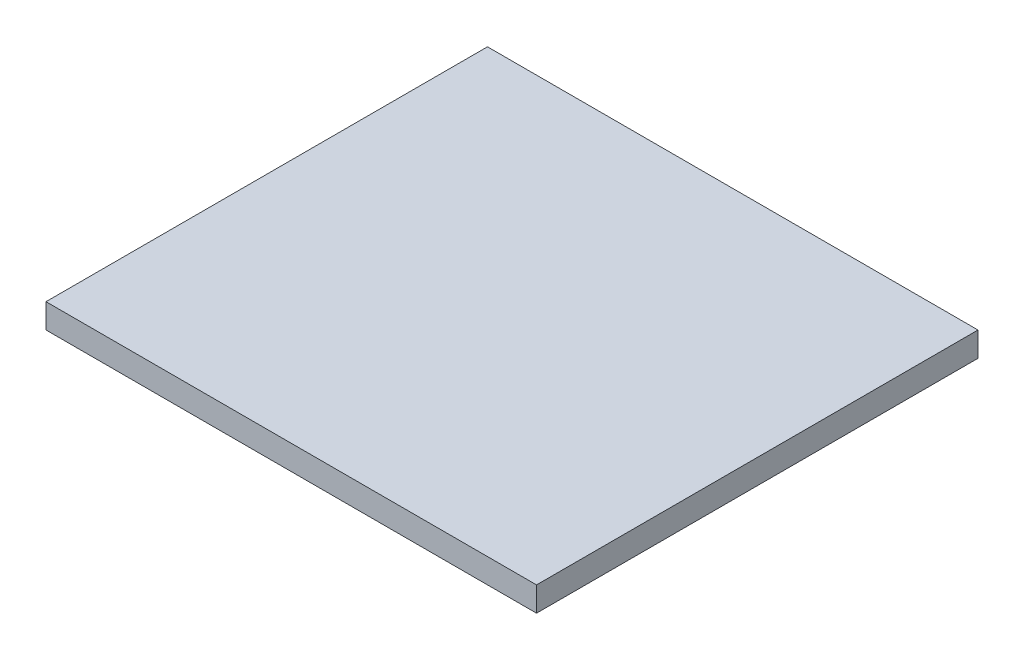
ISO-10303-21;
HEADER;
FILE_DESCRIPTION(('STEP AP214'),'2;1');
FILE_NAME('part.step','',(''),(''),'','','');
FILE_SCHEMA(('AUTOMOTIVE_DESIGN { 1 0 10303 214 1 1 1 1 }'));
ENDSEC;
DATA;
#1=APPLICATION_CONTEXT('core data for automotive mechanical design processes');
#2=APPLICATION_PROTOCOL_DEFINITION('international standard','automotive_design',2000,#1);
#3=PRODUCT_CONTEXT('',#1,'mechanical');
#4=PRODUCT('Part','Part','',(#3));
#5=PRODUCT_RELATED_PRODUCT_CATEGORY('part','',(#4));
#6=PRODUCT_DEFINITION_FORMATION('','',#4);
#7=PRODUCT_DEFINITION_CONTEXT('part definition',#1,'design');
#8=PRODUCT_DEFINITION('design','',#6,#7);
#9=PRODUCT_DEFINITION_SHAPE('','',#8);
#10=(LENGTH_UNIT() NAMED_UNIT(*) SI_UNIT(.MILLI.,.METRE.));
#11=(NAMED_UNIT(*) PLANE_ANGLE_UNIT() SI_UNIT($,.RADIAN.));
#12=(NAMED_UNIT(*) SI_UNIT($,.STERADIAN.) SOLID_ANGLE_UNIT());
#13=UNCERTAINTY_MEASURE_WITH_UNIT(LENGTH_MEASURE(1.E-05),#10,'distance_accuracy_value','');
#14=(GEOMETRIC_REPRESENTATION_CONTEXT(3) GLOBAL_UNCERTAINTY_ASSIGNED_CONTEXT((#13)) GLOBAL_UNIT_ASSIGNED_CONTEXT((#10,
#11,#12)) REPRESENTATION_CONTEXT('',''));
#15=CARTESIAN_POINT('',(0.,0.,0.));
#16=DIRECTION('',(0.,0.,1.));
#17=DIRECTION('',(1.,0.,0.));
#18=AXIS2_PLACEMENT_3D('',#15,#16,#17);
#19=CARTESIAN_POINT('',(0.,1.,0.));
#20=DIRECTION('',(1.,0.,0.));
#21=DIRECTION('',(0.,0.,-1.));
#22=AXIS2_PLACEMENT_3D('',#19,#20,#21);
#23=PLANE('',#22);
#24=DIRECTION('',(0.,0.,1.));
#25=VECTOR('',#24,1.);
#26=CARTESIAN_POINT('',(0.,0.,0.));
#27=LINE('',#26,#25);
#28=CARTESIAN_POINT('',(0.,0.,-18.));
#29=VERTEX_POINT('',#28);
#30=CARTESIAN_POINT('',(0.,0.,0.));
#31=VERTEX_POINT('',#30);
#32=EDGE_CURVE('E98',#29,#31,#27,.T.);
#33=ORIENTED_EDGE('',*,*,#32,.T.);
#34=DIRECTION('',(0.,-1.,0.));
#35=VECTOR('',#34,1.);
#36=CARTESIAN_POINT('',(0.,1.,0.));
#37=LINE('',#36,#35);
#38=CARTESIAN_POINT('',(0.,1.,0.));
#39=VERTEX_POINT('',#38);
#40=EDGE_CURVE('E11',#39,#31,#37,.T.);
#41=ORIENTED_EDGE('',*,*,#40,.F.);
#42=DIRECTION('',(0.,0.,1.));
#43=VECTOR('',#42,1.);
#44=CARTESIAN_POINT('',(0.,1.,0.));
#45=LINE('',#44,#43);
#46=CARTESIAN_POINT('',(0.,1.,-18.));
#47=VERTEX_POINT('',#46);
#48=EDGE_CURVE('E86',#47,#39,#45,.T.);
#49=ORIENTED_EDGE('',*,*,#48,.F.);
#50=DIRECTION('',(0.,-1.,0.));
#51=VECTOR('',#50,1.);
#52=CARTESIAN_POINT('',(0.,1.,-18.));
#53=LINE('',#52,#51);
#54=EDGE_CURVE('E94',#47,#29,#53,.T.);
#55=ORIENTED_EDGE('',*,*,#54,.T.);
#56=EDGE_LOOP('',(#33,#41,#49,#55));
#57=FACE_BOUND('',#56,.T.);
#58=ADVANCED_FACE('F35',(#57),#23,.F.);
#59=CARTESIAN_POINT('',(0.,1.,0.));
#60=DIRECTION('',(0.,0.,-1.));
#61=DIRECTION('',(-1.,0.,0.));
#62=AXIS2_PLACEMENT_3D('',#59,#60,#61);
#63=PLANE('',#62);
#64=DIRECTION('',(1.,0.,0.));
#65=VECTOR('',#64,1.);
#66=CARTESIAN_POINT('',(0.,0.,0.));
#67=LINE('',#66,#65);
#68=CARTESIAN_POINT('',(20.,0.,0.));
#69=VERTEX_POINT('',#68);
#70=EDGE_CURVE('E90',#31,#69,#67,.T.);
#71=ORIENTED_EDGE('',*,*,#70,.T.);
#72=DIRECTION('',(0.,-1.,0.));
#73=VECTOR('',#72,1.);
#74=CARTESIAN_POINT('',(20.,1.,0.));
#75=LINE('',#74,#73);
#76=CARTESIAN_POINT('',(20.,1.,0.));
#77=VERTEX_POINT('',#76);
#78=EDGE_CURVE('E43',#77,#69,#75,.T.);
#79=ORIENTED_EDGE('',*,*,#78,.F.);
#80=DIRECTION('',(1.,0.,0.));
#81=VECTOR('',#80,1.);
#82=CARTESIAN_POINT('',(0.,1.,0.));
#83=LINE('',#82,#81);
#84=EDGE_CURVE('E81',#39,#77,#83,.T.);
#85=ORIENTED_EDGE('',*,*,#84,.F.);
#86=ORIENTED_EDGE('',*,*,#40,.T.);
#87=EDGE_LOOP('',(#71,#79,#85,#86));
#88=FACE_BOUND('',#87,.T.);
#89=ADVANCED_FACE('F89',(#88),#63,.F.);
#90=CARTESIAN_POINT('',(20.,1.,0.));
#91=DIRECTION('',(-1.,0.,0.));
#92=DIRECTION('',(0.,0.,1.));
#93=AXIS2_PLACEMENT_3D('',#90,#91,#92);
#94=PLANE('',#93);
#95=DIRECTION('',(0.,0.,-1.));
#96=VECTOR('',#95,1.);
#97=CARTESIAN_POINT('',(20.,0.,0.));
#98=LINE('',#97,#96);
#99=CARTESIAN_POINT('',(20.,0.,-18.));
#100=VERTEX_POINT('',#99);
#101=EDGE_CURVE('E68',#69,#100,#98,.T.);
#102=ORIENTED_EDGE('',*,*,#101,.T.);
#103=DIRECTION('',(0.,-1.,0.));
#104=VECTOR('',#103,1.);
#105=CARTESIAN_POINT('',(20.,1.,-18.));
#106=LINE('',#105,#104);
#107=CARTESIAN_POINT('',(20.,1.,-18.));
#108=VERTEX_POINT('',#107);
#109=EDGE_CURVE('E91',#108,#100,#106,.T.);
#110=ORIENTED_EDGE('',*,*,#109,.F.);
#111=DIRECTION('',(0.,0.,-1.));
#112=VECTOR('',#111,1.);
#113=CARTESIAN_POINT('',(20.,1.,0.));
#114=LINE('',#113,#112);
#115=EDGE_CURVE('E84',#77,#108,#114,.T.);
#116=ORIENTED_EDGE('',*,*,#115,.F.);
#117=ORIENTED_EDGE('',*,*,#78,.T.);
#118=EDGE_LOOP('',(#102,#110,#116,#117));
#119=FACE_BOUND('',#118,.T.);
#120=ADVANCED_FACE('F92',(#119),#94,.F.);
#121=CARTESIAN_POINT('',(0.,1.,-18.));
#122=DIRECTION('',(0.,0.,1.));
#123=DIRECTION('',(1.,0.,0.));
#124=AXIS2_PLACEMENT_3D('',#121,#122,#123);
#125=PLANE('',#124);
#126=DIRECTION('',(-1.,0.,0.));
#127=VECTOR('',#126,1.);
#128=CARTESIAN_POINT('',(0.,0.,-18.));
#129=LINE('',#128,#127);
#130=EDGE_CURVE('E74',#100,#29,#129,.T.);
#131=ORIENTED_EDGE('',*,*,#130,.T.);
#132=ORIENTED_EDGE('',*,*,#54,.F.);
#133=DIRECTION('',(-1.,0.,0.));
#134=VECTOR('',#133,1.);
#135=CARTESIAN_POINT('',(0.,1.,-18.));
#136=LINE('',#135,#134);
#137=EDGE_CURVE('E51',#108,#47,#136,.T.);
#138=ORIENTED_EDGE('',*,*,#137,.F.);
#139=ORIENTED_EDGE('',*,*,#109,.T.);
#140=EDGE_LOOP('',(#131,#132,#138,#139));
#141=FACE_BOUND('',#140,.T.);
#142=ADVANCED_FACE('F105',(#141),#125,.F.);
#143=CARTESIAN_POINT('',(0.,1.,0.));
#144=DIRECTION('',(0.,-1.,0.));
#145=DIRECTION('',(0.,0.,-1.));
#146=AXIS2_PLACEMENT_3D('',#143,#144,#145);
#147=PLANE('',#146);
#148=ORIENTED_EDGE('',*,*,#48,.T.);
#149=ORIENTED_EDGE('',*,*,#84,.T.);
#150=ORIENTED_EDGE('',*,*,#115,.T.);
#151=ORIENTED_EDGE('',*,*,#137,.T.);
#152=EDGE_LOOP('',(#148,#149,#150,#151));
#153=FACE_BOUND('',#152,.T.);
#154=ADVANCED_FACE('F82',(#153),#147,.F.);
#155=CARTESIAN_POINT('',(0.,0.,0.));
#156=DIRECTION('',(0.,-1.,0.));
#157=DIRECTION('',(0.,0.,-1.));
#158=AXIS2_PLACEMENT_3D('',#155,#156,#157);
#159=PLANE('',#158);
#160=ORIENTED_EDGE('',*,*,#32,.F.);
#161=ORIENTED_EDGE('',*,*,#130,.F.);
#162=ORIENTED_EDGE('',*,*,#101,.F.);
#163=ORIENTED_EDGE('',*,*,#70,.F.);
#164=EDGE_LOOP('',(#160,#161,#162,#163));
#165=FACE_BOUND('',#164,.T.);
#166=ADVANCED_FACE('F108',(#165),#159,.T.);
#167=CLOSED_SHELL('',(#58,#89,#120,#142,#154,#166));
#168=MANIFOLD_SOLID_BREP('B2',#167);
#169=ADVANCED_BREP_SHAPE_REPRESENTATION('',(#18,#168),#14);
#170=SHAPE_DEFINITION_REPRESENTATION(#9,#169);
ENDSEC;
END-ISO-10303-21;
